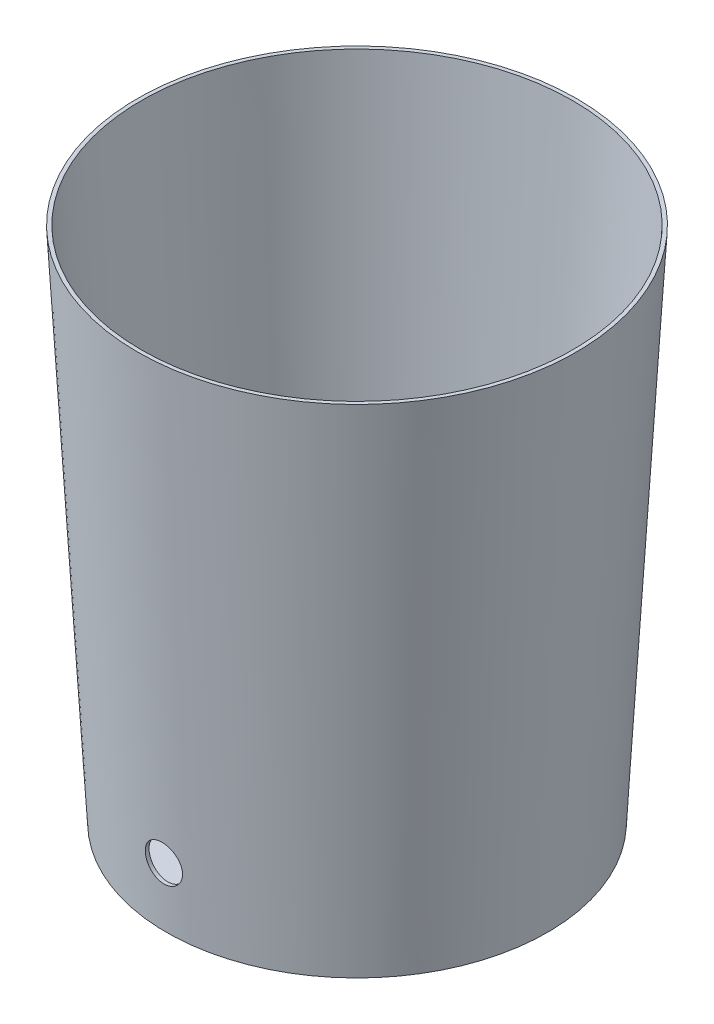
ISO-10303-21;
HEADER;
FILE_DESCRIPTION(('STEP AP214'),'2;1');
FILE_NAME('part.step','',(''),(''),'','','');
FILE_SCHEMA(('AUTOMOTIVE_DESIGN { 1 0 10303 214 1 1 1 1 }'));
ENDSEC;
DATA;
#1=APPLICATION_CONTEXT('core data for automotive mechanical design processes');
#2=APPLICATION_PROTOCOL_DEFINITION('international standard','automotive_design',2000,#1);
#3=PRODUCT_CONTEXT('',#1,'mechanical');
#4=PRODUCT('Part','Part','',(#3));
#5=PRODUCT_RELATED_PRODUCT_CATEGORY('part','',(#4));
#6=PRODUCT_DEFINITION_FORMATION('','',#4);
#7=PRODUCT_DEFINITION_CONTEXT('part definition',#1,'design');
#8=PRODUCT_DEFINITION('design','',#6,#7);
#9=PRODUCT_DEFINITION_SHAPE('','',#8);
#10=(LENGTH_UNIT() NAMED_UNIT(*) SI_UNIT(.MILLI.,.METRE.));
#11=(NAMED_UNIT(*) PLANE_ANGLE_UNIT() SI_UNIT($,.RADIAN.));
#12=(NAMED_UNIT(*) SI_UNIT($,.STERADIAN.) SOLID_ANGLE_UNIT());
#13=UNCERTAINTY_MEASURE_WITH_UNIT(LENGTH_MEASURE(1.E-05),#10,'distance_accuracy_value','');
#14=(GEOMETRIC_REPRESENTATION_CONTEXT(3) GLOBAL_UNCERTAINTY_ASSIGNED_CONTEXT((#13)) GLOBAL_UNIT_ASSIGNED_CONTEXT((#10,
#11,#12)) REPRESENTATION_CONTEXT('',''));
#15=CARTESIAN_POINT('',(0.,0.,0.));
#16=DIRECTION('',(0.,0.,1.));
#17=DIRECTION('',(1.,0.,0.));
#18=AXIS2_PLACEMENT_3D('',#15,#16,#17);
#19=CARTESIAN_POINT('',(0.,0.,0.));
#20=DIRECTION('',(0.,1.,0.));
#21=DIRECTION('',(0.,0.,1.));
#22=AXIS2_PLACEMENT_3D('',#19,#20,#21);
#23=CONICAL_SURFACE('',#22,130.048,0.0560563185594446);
#24=CARTESIAN_POINT('',(0.,0.,0.));
#25=DIRECTION('',(0.,-1.,0.));
#26=DIRECTION('',(0.,0.,-1.));
#27=AXIS2_PLACEMENT_3D('',#24,#25,#26);
#28=CIRCLE('',#27,130.048);
#29=CARTESIAN_POINT('',(0.,0.,-130.048));
#30=VERTEX_POINT('',#29);
#31=EDGE_CURVE('E38',#30,#30,#28,.T.);
#32=ORIENTED_EDGE('',*,*,#31,.F.);
#33=EDGE_LOOP('',(#32));
#34=FACE_BOUND('',#33,.T.);
#35=CARTESIAN_POINT('',(0.,353.06,0.));
#36=DIRECTION('',(0.,-1.,0.));
#37=DIRECTION('',(0.,0.,-1.));
#38=AXIS2_PLACEMENT_3D('',#35,#36,#37);
#39=CIRCLE('',#38,149.86);
#40=CARTESIAN_POINT('',(0.,353.06,-149.86));
#41=VERTEX_POINT('',#40);
#42=EDGE_CURVE('E10',#41,#41,#39,.T.);
#43=ORIENTED_EDGE('',*,*,#42,.T.);
#44=EDGE_LOOP('',(#43));
#45=FACE_BOUND('',#44,.T.);
#46=CARTESIAN_POINT('',(-8.96611341667262,33.178536092726,131.604744087475));
#47=CARTESIAN_POINT('',(-8.71339407323593,32.9266062959015,131.607791853812));
#48=CARTESIAN_POINT('',(-8.45008825536513,32.6853761707521,131.611436332096));
#49=CARTESIAN_POINT('',(-7.90402548270437,32.2258675419226,131.619527098657));
#50=CARTESIAN_POINT('',(-7.62126377357344,32.0075946813825,131.62397358335));
#51=CARTESIAN_POINT('',(-7.03808083279073,31.5954339567449,131.63328411453));
#52=CARTESIAN_POINT('',(-6.73764207964,31.4015709061304,131.638148577593));
#53=CARTESIAN_POINT('',(-6.12149416179478,31.0398572903617,131.647919871545));
#54=CARTESIAN_POINT('',(-5.80578506363416,30.8720066118833,131.652826702248));
#55=CARTESIAN_POINT('',(-5.16148344867759,30.5635803954936,131.662339499716));
#56=CARTESIAN_POINT('',(-4.83289675199193,30.4229927029633,131.666945599946));
#57=CARTESIAN_POINT('',(-4.16503497131094,30.1699965174747,131.675559934611));
#58=CARTESIAN_POINT('',(-3.82575973181666,30.057588434692,131.679568160344));
#59=CARTESIAN_POINT('',(-3.13902037100988,29.8617791776915,131.686737141057));
#60=CARTESIAN_POINT('',(-2.79155827118714,29.7783709213789,131.689898102904));
#61=CARTESIAN_POINT('',(-2.09083665923739,29.6411185724736,131.695184133778));
#62=CARTESIAN_POINT('',(-1.73757717052112,29.587274360527,131.697309206985));
#63=CARTESIAN_POINT('',(-1.02784634688952,29.5095424497694,131.700398297299));
#64=CARTESIAN_POINT('',(-0.671375690363775,29.4856485665251,131.701362554099));
#65=CARTESIAN_POINT('',(0.042313031503397,29.4679677493751,131.70207482165));
#66=CARTESIAN_POINT('',(0.399531097425884,29.4741808388843,131.701822831454));
#67=CARTESIAN_POINT('',(1.11218447046291,29.5166703343797,131.700117167217));
#68=CARTESIAN_POINT('',(1.46761971424062,29.5529478009335,131.698663450782));
#69=CARTESIAN_POINT('',(2.17416558548888,29.6553080703703,131.69463900117));
#70=CARTESIAN_POINT('',(2.52527621439795,29.7213908633386,131.692068268364));
#71=CARTESIAN_POINT('',(3.22049917589886,29.8828487518897,131.685963477002));
#72=CARTESIAN_POINT('',(3.56461498112769,29.9782089140695,131.682429909658));
#73=CARTESIAN_POINT('',(4.2435904312176,30.1975538020689,131.674613195985));
#74=CARTESIAN_POINT('',(4.57845007880125,30.3215385194689,131.670330049875));
#75=CARTESIAN_POINT('',(5.23654113565461,30.5972522985607,131.661284002063));
#76=CARTESIAN_POINT('',(5.55977247600375,30.7489815246608,131.656521097517));
#77=CARTESIAN_POINT('',(6.19231486380191,31.0791076451883,131.646832293974));
#78=CARTESIAN_POINT('',(6.50162590071808,31.2575045597934,131.641906394854));
#79=CARTESIAN_POINT('',(7.10436289920744,31.6398460567466,131.632241404228));
#80=CARTESIAN_POINT('',(7.39777675130544,31.8438097330211,131.627502455856));
#81=CARTESIAN_POINT('',(7.96638607932141,32.2757332080932,131.618594815001));
#82=CARTESIAN_POINT('',(8.24158154467054,32.5036930208112,131.614426122849));
#83=CARTESIAN_POINT('',(8.77179787602667,32.9819912828855,131.6070513793));
#84=CARTESIAN_POINT('',(9.02681879211276,33.2323296766882,131.603845325513));
#85=CARTESIAN_POINT('',(9.51487160471207,33.7536075152837,131.59878794074));
#86=CARTESIAN_POINT('',(9.74790351767337,34.0245469446663,131.596936608739));
#87=CARTESIAN_POINT('',(10.1902363771736,34.5849962136565,131.59496741361));
#88=CARTESIAN_POINT('',(10.3995459473271,34.8744992446582,131.594848918537));
#89=CARTESIAN_POINT('',(10.7930389724392,35.4700995833243,131.596694748496));
#90=CARTESIAN_POINT('',(10.9772224309667,35.7761968886317,131.598659073233));
#91=CARTESIAN_POINT('',(11.319146137341,36.4027904001637,131.604981629563));
#92=CARTESIAN_POINT('',(11.4768868521785,36.7232863519749,131.609339818875));
#93=CARTESIAN_POINT('',(11.7648059388257,37.376382841165,131.620709494032));
#94=CARTESIAN_POINT('',(11.8949843691154,37.7089833528594,131.627720974248));
#95=CARTESIAN_POINT('',(12.1265673198662,38.3830516511319,131.644573203457));
#96=CARTESIAN_POINT('',(12.2280431814769,38.724495108374,131.65440681305));
#97=CARTESIAN_POINT('',(12.4019496066315,39.414603638514,131.677035552918));
#98=CARTESIAN_POINT('',(12.474380225907,39.7632686975539,131.689830677511));
#99=CARTESIAN_POINT('',(12.5897055124039,40.4653238420143,131.718431018819));
#100=CARTESIAN_POINT('',(12.6326004686727,40.8187138811598,131.734236206075));
#101=CARTESIAN_POINT('',(12.6885835549458,41.5277016560341,131.768824752669));
#102=CARTESIAN_POINT('',(12.701671667134,41.8832993930824,131.787608113786));
#103=CARTESIAN_POINT('',(12.6979879651595,42.5940196456944,131.828029873005));
#104=CARTESIAN_POINT('',(12.6812292728401,42.9491423014357,131.849667012599));
#105=CARTESIAN_POINT('',(12.618038434439,43.6565621434421,131.895607595809));
#106=CARTESIAN_POINT('',(12.5716063141811,44.0088593321658,131.919911037104));
#107=CARTESIAN_POINT('',(12.4494369074511,44.7081667904806,131.970912295647));
#108=CARTESIAN_POINT('',(12.3736989135446,45.0551769322338,131.997610170684));
#109=CARTESIAN_POINT('',(12.1934883916552,45.7414861965656,132.05305546927));
#110=CARTESIAN_POINT('',(12.0890157324926,46.0807852839339,132.081802902176));
#111=CARTESIAN_POINT('',(11.8515023701119,46.7510047329293,132.141087316027));
#112=CARTESIAN_POINT('',(11.7183208057854,47.0818744476399,132.171632560543));
#113=CARTESIAN_POINT('',(11.4246620524798,47.731154189035,132.233909620906));
#114=CARTESIAN_POINT('',(11.2641847783715,48.0495641768565,132.265641440452));
#115=CARTESIAN_POINT('',(10.9170629705291,48.6717308032359,132.329776240888));
#116=CARTESIAN_POINT('',(10.7304174462116,48.9754868864936,132.362179247144));
#117=CARTESIAN_POINT('',(10.3322659867243,49.5662310703743,132.427104493109));
#118=CARTESIAN_POINT('',(10.1207599669889,49.8532191139539,132.459626733223));
#119=CARTESIAN_POINT('',(9.67305425750724,50.4100470803602,132.524405116475));
#120=CARTESIAN_POINT('',(9.43671849639743,50.6797779237454,132.556658623269));
#121=CARTESIAN_POINT('',(8.94202050182749,51.1983591166122,132.620114813272));
#122=CARTESIAN_POINT('',(8.68365816651335,51.4472093695284,132.651317491621));
#123=CARTESIAN_POINT('',(8.14670377984787,51.9222569873591,132.712083961973));
#124=CARTESIAN_POINT('',(7.86811169333073,52.148454312894,132.741647751128));
#125=CARTESIAN_POINT('',(7.29264219783904,52.5765648848672,132.798566058467));
#126=CARTESIAN_POINT('',(6.99576485298664,52.7784782164566,132.825920584399));
#127=CARTESIAN_POINT('',(6.38634435520244,53.1562135697238,132.877836070575));
#128=CARTESIAN_POINT('',(6.07382966633143,53.3320808450906,132.902401858343));
#129=CARTESIAN_POINT('',(5.43485839051066,53.65684720069,132.948304192162));
#130=CARTESIAN_POINT('',(5.10840180415291,53.8057462820678,132.969640738351));
#131=CARTESIAN_POINT('',(4.4438882527253,54.0754514926518,133.008650093107));
#132=CARTESIAN_POINT('',(4.10583185378053,54.1962589906271,133.026323080178));
#133=CARTESIAN_POINT('',(3.42053628884565,54.4088693810475,133.057642448739));
#134=CARTESIAN_POINT('',(3.07329719635452,54.5006725055697,133.071288862448));
#135=CARTESIAN_POINT('',(2.37546971647947,54.6538398535461,133.094162425034));
#136=CARTESIAN_POINT('',(2.02494395058972,54.7154834143927,133.103430101072));
#137=CARTESIAN_POINT('',(1.31986888715194,54.8091470624552,133.117544993684));
#138=CARTESIAN_POINT('',(0.965319614550741,54.8411673332421,133.12239223765));
#139=CARTESIAN_POINT('',(0.254766684175217,54.8753377467767,133.127565786246));
#140=CARTESIAN_POINT('',(-0.10123691201327,54.8774891415225,133.127892280369));
#141=CARTESIAN_POINT('',(-0.812143477532013,54.8519083921483,133.124018026923));
#142=CARTESIAN_POINT('',(-1.16704645028343,54.8241763410108,133.119817293441));
#143=CARTESIAN_POINT('',(-1.87073065514551,54.7393395634927,133.107020546449));
#144=CARTESIAN_POINT('',(-2.21953731288543,54.6824408765142,133.09845536682));
#145=CARTESIAN_POINT('',(-2.91107254133534,54.539815950943,133.077120972344));
#146=CARTESIAN_POINT('',(-3.25380114686196,54.4540898775371,133.064351781587));
#147=CARTESIAN_POINT('',(-3.93077499763013,54.2544501434953,133.034866951816));
#148=CARTESIAN_POINT('',(-4.26502017156767,54.1405362460246,133.018151279642));
#149=CARTESIAN_POINT('',(-4.92269624808274,53.8853623195614,132.981107348961));
#150=CARTESIAN_POINT('',(-5.24612709534936,53.7441021507288,132.960779071979));
#151=CARTESIAN_POINT('',(-5.88106451896208,53.4347170639679,132.916832849054));
#152=CARTESIAN_POINT('',(-6.19252478441945,53.2664987315961,132.893203502278));
#153=CARTESIAN_POINT('',(-6.80016025652972,52.9047735987221,132.843171934372));
#154=CARTESIAN_POINT('',(-7.09633544470945,52.7112667676579,132.81676970989));
#155=CARTESIAN_POINT('',(-7.67139362328048,52.3003317015413,132.761697951078));
#156=CARTESIAN_POINT('',(-7.95027577868377,52.0829023128007,132.733028307418));
#157=CARTESIAN_POINT('',(-8.48884263580507,51.6256549251865,132.673962344577));
#158=CARTESIAN_POINT('',(-8.7485271995588,51.3858367654431,132.64356601299));
#159=CARTESIAN_POINT('',(-9.24941651468251,50.882991532174,132.581298812551));
#160=CARTESIAN_POINT('',(-9.49041249762824,50.6197579085862,132.549416311391));
#161=CARTESIAN_POINT('',(-9.94937411209316,50.0739938211128,132.485044589383));
#162=CARTESIAN_POINT('',(-10.167339593948,49.791463231845,132.452555364595));
#163=CARTESIAN_POINT('',(-10.5787390689435,49.2090617201526,132.387547150096));
#164=CARTESIAN_POINT('',(-10.7721722519808,48.9091902255739,132.355028159438));
#165=CARTESIAN_POINT('',(-11.1331500109715,48.2941954229253,132.290520801984));
#166=CARTESIAN_POINT('',(-11.3006945458573,47.979072090662,132.258532436031));
#167=CARTESIAN_POINT('',(-11.6095394755212,47.3340309963425,132.195445502152));
#168=CARTESIAN_POINT('',(-11.750694200539,47.0040429131143,132.164352630809));
#169=CARTESIAN_POINT('',(-12.0046167728489,46.3331783657048,132.103729963193));
#170=CARTESIAN_POINT('',(-12.1173844876241,45.9923018507023,132.074200174217));
#171=CARTESIAN_POINT('',(-12.3136911496974,45.3020876209132,132.017143108611));
#172=CARTESIAN_POINT('',(-12.397231578177,44.9527503358613,131.989615730558));
#173=CARTESIAN_POINT('',(-12.5344528780735,44.2480837965398,131.936934781173));
#174=CARTESIAN_POINT('',(-12.5881339189612,43.8927545762898,131.911781196369));
#175=CARTESIAN_POINT('',(-12.6650616773021,43.1799946938948,131.864236847665));
#176=CARTESIAN_POINT('',(-12.6884223639231,42.8225770036057,131.841836025889));
#177=CARTESIAN_POINT('',(-12.7048716225882,42.1068753908433,131.799904158415));
#178=CARTESIAN_POINT('',(-12.6979601372497,41.7485914667294,131.780373118159));
#179=CARTESIAN_POINT('',(-12.6538692508348,41.0336653207553,131.744311397352));
#180=CARTESIAN_POINT('',(-12.6166837241654,40.6770234458324,131.727781324839));
#181=CARTESIAN_POINT('',(-12.512270970942,39.9680403808269,131.697776266778));
#182=CARTESIAN_POINT('',(-12.4450443081205,39.6156991101695,131.684301223907));
#183=CARTESIAN_POINT('',(-12.2814875701692,38.9199088993139,131.660441802266));
#184=CARTESIAN_POINT('',(-12.1853299894472,38.5764200067528,131.650039810269));
#185=CARTESIAN_POINT('',(-11.9644453461492,37.8986778627077,131.632109329576));
#186=CARTESIAN_POINT('',(-11.8397182208226,37.5644246315108,131.624580847192));
#187=CARTESIAN_POINT('',(-11.5627060168371,36.90787349944,131.612219940267));
#188=CARTESIAN_POINT('',(-11.4104485272644,36.5855640154825,131.607384836222));
#189=CARTESIAN_POINT('',(-11.0794328872778,35.9549560145668,131.600152832775));
#190=CARTESIAN_POINT('',(-10.9006811398642,35.6466541357762,131.59775534536));
#191=CARTESIAN_POINT('',(-10.4595768890104,34.9546787451236,131.59469371455));
#192=CARTESIAN_POINT('',(-10.188338188554,34.5766240435123,131.594779205186));
#193=CARTESIAN_POINT('',(-9.60608301438736,33.8525154422076,131.597820823853));
#194=CARTESIAN_POINT('',(-9.29506656411856,33.5064615236562,131.600776950192));
#195=CARTESIAN_POINT('',(-8.96611341667262,33.178536092726,131.604744087475));
#196=B_SPLINE_CURVE_WITH_KNOTS('',3,(#46,#47,#48,#49,#50,#51,#52,#53,#54,#55,#56,#57,#58,#59,
#60,#61,#62,#63,#64,#65,#66,#67,#68,#69,#70,#71,#72,#73,#74,#75,#76,#77,#78,#79,#80,#81,#82,#83,
#84,#85,#86,#87,#88,#89,#90,#91,#92,#93,#94,#95,#96,#97,#98,#99,#100,#101,#102,#103,#104,#105,
#106,#107,#108,#109,#110,#111,#112,#113,#114,#115,#116,#117,#118,#119,#120,#121,#122,#123,#124,
#125,#126,#127,#128,#129,#130,#131,#132,#133,#134,#135,#136,#137,#138,#139,#140,#141,#142,#143,
#144,#145,#146,#147,#148,#149,#150,#151,#152,#153,#154,#155,#156,#157,#158,#159,#160,#161,#162,
#163,#164,#165,#166,#167,#168,#169,#170,#171,#172,#173,#174,#175,#176,#177,#178,#179,#180,#181,
#182,#183,#184,#185,#186,#187,#188,#189,#190,#191,#192,#193,#194,#195),.UNSPECIFIED.,.T.,.F.,(4,
2,2,2,2,2,2,2,2,2,2,2,2,2,2,2,2,2,2,2,2,2,2,2,2,2,2,2,2,2,2,2,2,2,2,2,2,2,2,2,2,2,2,2,2,2,2,2,2,
2,2,2,2,2,2,2,2,2,2,2,2,2,2,2,2,2,2,2,2,2,2,2,2,2,4),(0.,1.07015744726657,2.14057733884107,
3.21207671502486,4.28357142303767,5.3545873242409,6.42561881398781,7.49638856137279,
8.56715398588944,9.63769827197179,10.7082433906417,11.7788262760639,12.8494088053639,
13.919446171129,14.9894832221525,16.0595266142034,17.1295708158931,18.2004189697343,
19.2712677447901,20.3421138616053,21.4129591774064,22.4834139592971,23.5538685891438,
24.6243043122908,25.6947377642283,26.762486758846,27.8302337046737,28.8979702009648,
29.965707335454,31.0329751660681,32.1002420678823,33.1675347347862,34.234832274181,
35.3074908383954,36.3801527480508,37.4528552736485,38.5255614482649,39.6044875408619,
40.6834186228375,41.762351580386,42.8412807545826,43.9183127805366,44.9953447607586,
46.0723242513413,47.1492951243064,48.2160928237583,49.2828839123829,50.3496302847407,
51.4163733379143,52.4756824606733,53.5349855134786,54.5942974668737,55.6536148373922,
56.716685609163,57.779757665705,58.842881012402,59.9060119985361,60.9796844780001,
62.0533639343238,63.127078836368,64.2007954416554,65.2802743543785,66.3597583062536,
67.4391875440773,68.5186106554024,69.5939645309702,70.6693204449333,71.744893998494,
72.8204473693824,73.8897109559378,74.9589768910641,76.027177159252,77.0951196897859,
78.4880952460228,79.8810699813709),.UNSPECIFIED.);
#197=CARTESIAN_POINT('',(-8.96611341667262,33.178536092726,131.604744087475));
#198=VERTEX_POINT('',#197);
#199=EDGE_CURVE('E51',#198,#198,#196,.T.);
#200=ORIENTED_EDGE('',*,*,#199,.F.);
#201=EDGE_LOOP('',(#200));
#202=FACE_BOUND('',#201,.T.);
#203=ADVANCED_FACE('F31',(#34,#45,#202),#23,.T.);
#204=CARTESIAN_POINT('',(0.,0.142308492222647,0.));
#205=DIRECTION('',(0.,1.,0.));
#206=DIRECTION('',(0.,0.,1.));
#207=AXIS2_PLACEMENT_3D('',#204,#205,#206);
#208=CONICAL_SURFACE('',#207,127.511989689879,0.0560563185594446);
#209=CARTESIAN_POINT('',(0.,353.06,0.));
#210=DIRECTION('',(0.,1.,0.));
#211=DIRECTION('',(0.,0.,1.));
#212=AXIS2_PLACEMENT_3D('',#209,#210,#211);
#213=CIRCLE('',#212,147.316004033481);
#214=CARTESIAN_POINT('',(0.,353.06,147.316004033481));
#215=VERTEX_POINT('',#214);
#216=EDGE_CURVE('E42',#215,#215,#213,.F.);
#217=ORIENTED_EDGE('',*,*,#216,.F.);
#218=EDGE_LOOP('',(#217));
#219=FACE_BOUND('',#218,.T.);
#220=CARTESIAN_POINT('',(0.,2.54000000000001,0.));
#221=DIRECTION('',(0.,-1.,0.));
#222=DIRECTION('',(0.,0.,-1.));
#223=AXIS2_PLACEMENT_3D('',#220,#221,#222);
#224=CIRCLE('',#223,127.646536407581);
#225=CARTESIAN_POINT('',(0.,2.54000000000001,-127.646536407581));
#226=VERTEX_POINT('',#225);
#227=EDGE_CURVE('E46',#226,#226,#224,.T.);
#228=ORIENTED_EDGE('',*,*,#227,.T.);
#229=EDGE_LOOP('',(#228));
#230=FACE_BOUND('',#229,.T.);
#231=CARTESIAN_POINT('',(-8.96921369555703,33.1816276952065,129.054692971913));
#232=CARTESIAN_POINT('',(-8.71657872578282,32.9296082632992,129.058074785013));
#233=CARTESIAN_POINT('',(-8.45335402591054,32.6882857369348,129.062054063854));
#234=CARTESIAN_POINT('',(-7.90744591415742,32.2285863500447,129.07080645435));
#235=CARTESIAN_POINT('',(-7.62475776011707,32.0102151144469,129.07557975987));
#236=CARTESIAN_POINT('',(-7.04171433086842,31.5978524946092,129.085526712161));
#237=CARTESIAN_POINT('',(-6.7413415743394,31.4038858492071,129.090700756714));
#238=CARTESIAN_POINT('',(-6.12531634681961,31.0419597411137,129.101064711777));
#239=CARTESIAN_POINT('',(-5.80966394343236,30.87400016337,129.106254622218));
#240=CARTESIAN_POINT('',(-5.16546445284075,30.5653510751054,129.116298793869));
#241=CARTESIAN_POINT('',(-4.83692314366933,30.4246495092041,129.121153202848));
#242=CARTESIAN_POINT('',(-4.16914142263034,30.1714221468572,129.130222312792));
#243=CARTESIAN_POINT('',(-3.82990085560073,30.0588967592381,129.134437004474));
#244=CARTESIAN_POINT('',(-3.14321973654518,29.8628505386485,129.141971020748));
#245=CARTESIAN_POINT('',(-2.79578120692473,29.7793226303793,129.145290563709));
#246=CARTESIAN_POINT('',(-2.09509571335605,29.6418297544482,129.150841278702));
#247=CARTESIAN_POINT('',(-1.74184877307314,29.5878646663687,129.153072455166));
#248=CARTESIAN_POINT('',(-1.03214950403648,29.509892776757,129.156318020131));
#249=CARTESIAN_POINT('',(-0.675698015766446,29.4858783381351,129.157332718817));
#250=CARTESIAN_POINT('',(0.0379627374635045,29.4679543138704,129.158088802497));
#251=CARTESIAN_POINT('',(0.395172002987767,29.4740447506559,129.157830186542));
#252=CARTESIAN_POINT('',(1.10781786458916,29.5162876852023,129.156054242211));
#253=CARTESIAN_POINT('',(1.46325439818218,29.5524412351798,129.154536869778));
#254=CARTESIAN_POINT('',(2.16981284611776,29.6545531582309,129.150329729512));
#255=CARTESIAN_POINT('',(2.52093476194639,29.7205115210387,129.147639962083));
#256=CARTESIAN_POINT('',(3.21617545029815,29.8817173659372,129.141245149641));
#257=CARTESIAN_POINT('',(3.56029797812926,29.9769486755987,129.137540665352));
#258=CARTESIAN_POINT('',(4.23929760299591,30.1960343041502,129.1293347497));
#259=CARTESIAN_POINT('',(4.57417470305753,30.3198886136717,129.124833318598));
#260=CARTESIAN_POINT('',(5.23231197519697,30.5953409579208,129.115309311329));
#261=CARTESIAN_POINT('',(5.55557207298117,30.7469391700398,129.110286731831));
#262=CARTESIAN_POINT('',(6.18818363138634,31.0768036501997,129.100044339459));
#263=CARTESIAN_POINT('',(6.4975350805353,31.2550699402363,129.094824526424));
#264=CARTESIAN_POINT('',(7.10038471197353,31.6371641732157,129.084545024039));
#265=CARTESIAN_POINT('',(7.39386974470933,31.8410128670512,129.079485468901));
#266=CARTESIAN_POINT('',(7.96263148960909,32.2727125076554,129.06991945104));
#267=CARTESIAN_POINT('',(8.23790819040573,32.5005634694081,129.065412988663));
#268=CARTESIAN_POINT('',(8.76829695676122,32.9786515307862,129.057355036501));
#269=CARTESIAN_POINT('',(9.02340906577296,33.2288885821691,129.053803544658));
#270=CARTESIAN_POINT('',(9.51165369671817,33.7499724959349,129.048057375387));
#271=CARTESIAN_POINT('',(9.74478623502652,34.0208193429632,129.045862696949));
#272=CARTESIAN_POINT('',(10.1873368250972,34.5811033779113,129.043218724284));
#273=CARTESIAN_POINT('',(10.3967626634581,34.8705344125118,129.042768855341));
#274=CARTESIAN_POINT('',(10.7904940685425,35.4660028801145,129.043973371755));
#275=CARTESIAN_POINT('',(10.9747996379552,35.7720403113389,129.045627756888));
#276=CARTESIAN_POINT('',(11.316971874599,36.3985264141678,129.051360767439));
#277=CARTESIAN_POINT('',(11.4748390268837,36.7189748212438,129.055439348376));
#278=CARTESIAN_POINT('',(11.763013917498,37.3719887394737,129.066288164015));
#279=CARTESIAN_POINT('',(11.8933217174391,37.7045542235366,129.0730583927));
#280=CARTESIAN_POINT('',(12.1251514045724,38.3785264503307,129.089472999519));
#281=CARTESIAN_POINT('',(12.2267478401887,38.7199077371315,129.099109798442));
#282=CARTESIAN_POINT('',(12.4009021953131,39.4099017186879,129.121394773924));
#283=CARTESIAN_POINT('',(12.4734601726528,39.7585143990405,129.134042944485));
#284=CARTESIAN_POINT('',(12.5890460222387,40.4604740092423,129.162403224494));
#285=CARTESIAN_POINT('',(12.6320742058708,40.8138208891303,129.178115301631));
#286=CARTESIAN_POINT('',(12.6883290623033,41.5227313847736,129.212573884716));
#287=CARTESIAN_POINT('',(12.7015557189827,41.8782950017278,129.231320392306));
#288=CARTESIAN_POINT('',(12.6981542356723,42.5889151076991,129.27172315568));
#289=CARTESIAN_POINT('',(12.6815426181527,42.9439717684876,129.293377794989));
#290=CARTESIAN_POINT('',(12.6186575862105,43.6512689871147,129.339408867401));
#291=CARTESIAN_POINT('',(12.5723842003576,44.0035095476655,129.363785297883));
#292=CARTESIAN_POINT('',(12.450543790834,44.7027142750669,129.414985702643));
#293=CARTESIAN_POINT('',(12.374976049666,45.0496783124648,129.441809736858));
#294=CARTESIAN_POINT('',(12.1951173332474,45.7359072265355,129.497556767229));
#295=CARTESIAN_POINT('',(12.0908262235504,46.0751720671623,129.526479773209));
#296=CARTESIAN_POINT('',(11.8536766872504,46.745367662667,129.586163498656));
#297=CARTESIAN_POINT('',(11.7206748402969,47.0762469007938,129.616932862829));
#298=CARTESIAN_POINT('',(11.4273805156463,47.7255591999766,129.679696996807));
#299=CARTESIAN_POINT('',(11.2670879516692,48.0439922216799,129.711691770486));
#300=CARTESIAN_POINT('',(10.920339160567,48.6662206344784,129.776384098022));
#301=CARTESIAN_POINT('',(10.7338819113224,48.9700154531113,129.809081679292));
#302=CARTESIAN_POINT('',(10.3361089591888,49.560854310571,129.874619648702));
#303=CARTESIAN_POINT('',(10.124793167945,49.8478982898548,129.90746003735));
#304=CARTESIAN_POINT('',(9.67742020155797,50.4049176798932,129.972898724307));
#305=CARTESIAN_POINT('',(9.44122184614307,50.674780032068,130.005494378091));
#306=CARTESIAN_POINT('',(8.94678621194161,51.1936353099488,130.069640461353));
#307=CARTESIAN_POINT('',(8.68854882785942,51.4426281359354,130.101190885838));
#308=CARTESIAN_POINT('',(8.15182973794843,51.9179717371703,130.162648902894));
#309=CARTESIAN_POINT('',(7.87334798708144,52.1443224620435,130.192556491811));
#310=CARTESIAN_POINT('',(7.29808263354802,52.5727496184957,130.250148963893));
#311=CARTESIAN_POINT('',(7.0012990956554,52.7748261359786,130.277833854923));
#312=CARTESIAN_POINT('',(6.39203412011666,53.1529042784619,130.330388099084));
#313=CARTESIAN_POINT('',(6.07958045901972,53.328949999829,130.355262196463));
#314=CARTESIAN_POINT('',(5.44071039241117,53.6540770142389,130.401749794049));
#315=CARTESIAN_POINT('',(5.11429398664333,53.8031583067867,130.423363294195));
#316=CARTESIAN_POINT('',(4.44983993789614,54.0732289314128,130.462887366989));
#317=CARTESIAN_POINT('',(4.11180287564765,54.1942196649529,130.480798124365));
#318=CARTESIAN_POINT('',(3.42652515800816,54.4071949578867,130.51254714832));
#319=CARTESIAN_POINT('',(3.07928457823267,54.4991797555114,130.526385448348));
#320=CARTESIAN_POINT('',(2.38150909174163,54.6526881044383,130.549587404351));
#321=CARTESIAN_POINT('',(2.03103839755993,54.7144972886843,130.558992988326));
#322=CARTESIAN_POINT('',(1.32605712677192,54.8084984777024,130.573331425707));
#323=CARTESIAN_POINT('',(0.971546575756419,54.8406906699805,130.57826430743));
#324=CARTESIAN_POINT('',(0.261055783721721,54.8752094131166,130.583554599326));
#325=CARTESIAN_POINT('',(-0.0949243933732647,54.877537249572,130.583912206455));
#326=CARTESIAN_POINT('',(-0.805798878088173,54.8523125671647,130.580044985492));
#327=CARTESIAN_POINT('',(-1.16069318919224,54.8247601442778,130.575820172119));
#328=CARTESIAN_POINT('',(-1.86430501643035,54.7402918561648,130.562922612593));
#329=CARTESIAN_POINT('',(-2.21304856847377,54.6835877525564,130.55428194642));
#330=CARTESIAN_POINT('',(-2.90447318273472,54.5413648260024,130.532747107736));
#331=CARTESIAN_POINT('',(-3.24715428061325,54.4558461726109,130.519852960254));
#332=CARTESIAN_POINT('',(-3.92404974321952,54.2566333048397,130.490072393161));
#333=CARTESIAN_POINT('',(-4.2582640347902,54.1429388470995,130.473185939067));
#334=CARTESIAN_POINT('',(-4.91589621418632,53.8882149623,130.43575948987));
#335=CARTESIAN_POINT('',(-5.23931404546117,53.7471853920889,130.415219475633));
#336=CARTESIAN_POINT('',(-5.87426938703989,53.4382604758546,130.370812217285));
#337=CARTESIAN_POINT('',(-6.1857596469409,53.2702697139373,130.346933196549));
#338=CARTESIAN_POINT('',(-6.79347420446903,52.9090044954292,130.296373458405));
#339=CARTESIAN_POINT('',(-7.08969848327143,52.7157300076617,130.269692737542));
#340=CARTESIAN_POINT('',(-7.66487598414564,52.3052623966921,130.214042775172));
#341=CARTESIAN_POINT('',(-7.94382835164994,52.0880680914771,130.185073420589));
#342=CARTESIAN_POINT('',(-8.48255811605791,51.6312914747004,130.125395016079));
#343=CARTESIAN_POINT('',(-8.74233537185182,51.3917089984134,130.094685953353));
#344=CARTESIAN_POINT('',(-9.24349602712496,50.8892740618525,130.031777945308));
#345=CARTESIAN_POINT('',(-9.48466573313519,50.62620991252,129.999567032882));
#346=CARTESIAN_POINT('',(-9.94398885130715,50.0807700845785,129.934542492766));
#347=CARTESIAN_POINT('',(-10.1621421101512,49.7983942773509,129.901728861062));
#348=CARTESIAN_POINT('',(-10.5739308294024,49.2162851300556,129.836084953645));
#349=CARTESIAN_POINT('',(-10.7675654636635,48.9165512056083,129.803254677408));
#350=CARTESIAN_POINT('',(-11.1289585828506,48.301812159643,129.738146738335));
#351=CARTESIAN_POINT('',(-11.2967170265293,47.9868070137834,129.705869076381));
#352=CARTESIAN_POINT('',(-11.6060167774978,47.3419500172412,129.642229282848));
#353=CARTESIAN_POINT('',(-11.7474098296389,47.0120264502652,129.610873117217));
#354=CARTESIAN_POINT('',(-12.0018122059343,46.3412654079454,129.549762498733));
#355=CARTESIAN_POINT('',(-12.1148213950107,46.0004278806711,129.520008053504));
#356=CARTESIAN_POINT('',(-12.3116111902881,45.3102658316424,129.462547136024));
#357=CARTESIAN_POINT('',(-12.3953932976131,44.9609417467496,129.434840558651));
#358=CARTESIAN_POINT('',(-12.5330951832697,44.2562758233529,129.381852174129));
#359=CARTESIAN_POINT('',(-12.5870151360739,43.9009340200206,129.356570352814));
#360=CARTESIAN_POINT('',(-12.6644078886837,43.1881808284451,129.308828745426));
#361=CARTESIAN_POINT('',(-12.6879994623859,42.8307830536909,129.286358263653));
#362=CARTESIAN_POINT('',(-12.7049116171017,42.1150980620407,129.244343173161));
#363=CARTESIAN_POINT('',(-12.6982321439213,41.7568108435534,129.224798569679));
#364=CARTESIAN_POINT('',(-12.6546040267168,41.0418564417086,129.188766523713));
#365=CARTESIAN_POINT('',(-12.6176493122566,40.6851895976724,129.172279695151));
#366=CARTESIAN_POINT('',(-12.5136948187807,39.9761355027523,129.142416845313));
#367=CARTESIAN_POINT('',(-12.4466956049627,39.6237481714902,129.129040765525));
#368=CARTESIAN_POINT('',(-12.2836018491819,38.9279083535872,129.105433580736));
#369=CARTESIAN_POINT('',(-12.1876850393511,38.5844148262834,129.095184012755));
#370=CARTESIAN_POINT('',(-11.9672855771606,37.9066416316045,129.077605363398));
#371=CARTESIAN_POINT('',(-11.8428028608833,37.5723619848478,129.070276288558));
#372=CARTESIAN_POINT('',(-11.566280679768,36.9157350400787,129.058355283163));
#373=CARTESIAN_POINT('',(-11.4142686998095,36.5933762235562,129.053760642019));
#374=CARTESIAN_POINT('',(-11.0837441316659,35.9626476704236,129.047043844197));
#375=CARTESIAN_POINT('',(-10.9052379204087,35.6542745908238,129.04492109364));
#376=CARTESIAN_POINT('',(-10.4642447518429,34.9613983566743,129.042520751946));
#377=CARTESIAN_POINT('',(-10.1927925928192,34.5825555176928,129.043008812368));
#378=CARTESIAN_POINT('',(-9.60996496413488,33.8569568465035,129.046890383721));
#379=CARTESIAN_POINT('',(-9.29858951383324,33.5102009987367,129.050283893242));
#380=CARTESIAN_POINT('',(-8.96921369555703,33.1816276952065,129.054692971913));
#381=B_SPLINE_CURVE_WITH_KNOTS('',3,(#231,#232,#233,#234,#235,#236,#237,#238,#239,#240,#241,
#242,#243,#244,#245,#246,#247,#248,#249,#250,#251,#252,#253,#254,#255,#256,#257,#258,#259,#260,
#261,#262,#263,#264,#265,#266,#267,#268,#269,#270,#271,#272,#273,#274,#275,#276,#277,#278,#279,
#280,#281,#282,#283,#284,#285,#286,#287,#288,#289,#290,#291,#292,#293,#294,#295,#296,#297,#298,
#299,#300,#301,#302,#303,#304,#305,#306,#307,#308,#309,#310,#311,#312,#313,#314,#315,#316,#317,
#318,#319,#320,#321,#322,#323,#324,#325,#326,#327,#328,#329,#330,#331,#332,#333,#334,#335,#336,
#337,#338,#339,#340,#341,#342,#343,#344,#345,#346,#347,#348,#349,#350,#351,#352,#353,#354,#355,
#356,#357,#358,#359,#360,#361,#362,#363,#364,#365,#366,#367,#368,#369,#370,#371,#372,#373,#374,
#375,#376,#377,#378,#379,#380),.UNSPECIFIED.,.T.,.F.,(4,2,2,2,2,2,2,2,2,2,2,2,2,2,2,2,2,2,2,2,2,
2,2,2,2,2,2,2,2,2,2,2,2,2,2,2,2,2,2,2,2,2,2,2,2,2,2,2,2,2,2,2,2,2,2,2,2,2,2,2,2,2,2,2,2,2,2,2,2,
2,2,2,2,2,4),(0.,1.070176496299,2.14061466404134,3.21212933494687,4.28363926545822,
5.35467421276198,6.42572469950391,7.4965136691309,8.56729827709946,9.63780979078584,
10.708322102006,11.7788718830034,12.8494212952664,13.9193803207322,14.9893389959892,
16.05930451268,17.1292709118739,18.2001108814041,19.2709515194448,20.3417898498569,
21.4126273824831,22.4831121656556,23.5535968342264,24.6240618609427,25.6945244945044,
26.7621816087373,27.8298365966689,28.8974803262172,29.9651246332993,31.0321779315508,
32.0992302020316,33.166308609135,34.2333920110294,35.3059345967053,36.3784805733044,
37.4510684604181,38.5236601599486,39.6027038029637,40.6817526016019,41.7608038009021,
42.8398511814357,43.9170491742049,44.9942471867428,46.0713914454047,47.1485268570616,
48.2152586081282,49.2819836056486,50.3486626827647,51.4153383337055,52.474372755914,
53.5334009465247,54.5924382845018,55.6514811687208,56.7143581935912,57.7772365290795,
58.8401674109629,59.9031061141813,60.9768441051534,62.0505892480806,63.1243705608321,
64.198153585199,65.2778036159781,66.3574587846843,67.4370584933625,68.5166518943103,
69.5920043136369,70.6673586581582,71.7429286729041,72.8184784548589,73.8875480254028,
74.9566199880629,76.0246304283143,77.0923842234915,78.4876401154483,79.8828953308426),.UNSPECIFIED.);
#382=CARTESIAN_POINT('',(-8.96921369555703,33.1816276952065,129.054692971913));
#383=VERTEX_POINT('',#382);
#384=EDGE_CURVE('E58',#383,#383,#381,.T.);
#385=ORIENTED_EDGE('',*,*,#384,.T.);
#386=EDGE_LOOP('',(#385));
#387=FACE_BOUND('',#386,.T.);
#388=ADVANCED_FACE('F75',(#219,#230,#387),#208,.F.);
#389=CARTESIAN_POINT('',(130.048,0.,0.));
#390=DIRECTION('',(0.,-1.,0.));
#391=DIRECTION('',(0.,0.,-1.));
#392=AXIS2_PLACEMENT_3D('',#389,#390,#391);
#393=PLANE('',#392);
#394=ORIENTED_EDGE('',*,*,#31,.T.);
#395=EDGE_LOOP('',(#394));
#396=FACE_BOUND('',#395,.T.);
#397=ADVANCED_FACE('F33',(#396),#393,.T.);
#398=CARTESIAN_POINT('',(0.,353.06,0.));
#399=DIRECTION('',(0.,1.,0.));
#400=DIRECTION('',(0.,0.,1.));
#401=AXIS2_PLACEMENT_3D('',#398,#399,#400);
#402=PLANE('',#401);
#403=ORIENTED_EDGE('',*,*,#216,.T.);
#404=EDGE_LOOP('',(#403));
#405=FACE_BOUND('',#404,.T.);
#406=ORIENTED_EDGE('',*,*,#42,.F.);
#407=EDGE_LOOP('',(#406));
#408=FACE_BOUND('',#407,.T.);
#409=ADVANCED_FACE('F73',(#405,#408),#402,.T.);
#410=CARTESIAN_POINT('',(130.048,2.54000000000001,0.));
#411=DIRECTION('',(0.,-1.,0.));
#412=DIRECTION('',(0.,0.,-1.));
#413=AXIS2_PLACEMENT_3D('',#410,#411,#412);
#414=PLANE('',#413);
#415=ORIENTED_EDGE('',*,*,#227,.F.);
#416=EDGE_LOOP('',(#415));
#417=FACE_BOUND('',#416,.T.);
#418=ADVANCED_FACE('F68',(#417),#414,.F.);
#419=CARTESIAN_POINT('',(0.,42.1729126803147,149.861));
#420=DIRECTION('',(0.,0.,-1.));
#421=DIRECTION('',(-1.,0.,0.));
#422=AXIS2_PLACEMENT_3D('',#419,#420,#421);
#423=CYLINDRICAL_SURFACE('',#422,12.7);
#424=ORIENTED_EDGE('',*,*,#199,.T.);
#425=EDGE_LOOP('',(#424));
#426=FACE_BOUND('',#425,.T.);
#427=ORIENTED_EDGE('',*,*,#384,.F.);
#428=EDGE_LOOP('',(#427));
#429=FACE_BOUND('',#428,.T.);
#430=ADVANCED_FACE('F62',(#426,#429),#423,.F.);
#431=CLOSED_SHELL('',(#203,#388,#397,#409,#418,#430));
#432=MANIFOLD_SOLID_BREP('B2',#431);
#433=ADVANCED_BREP_SHAPE_REPRESENTATION('',(#18,#432),#14);
#434=SHAPE_DEFINITION_REPRESENTATION(#9,#433);
ENDSEC;
END-ISO-10303-21;
